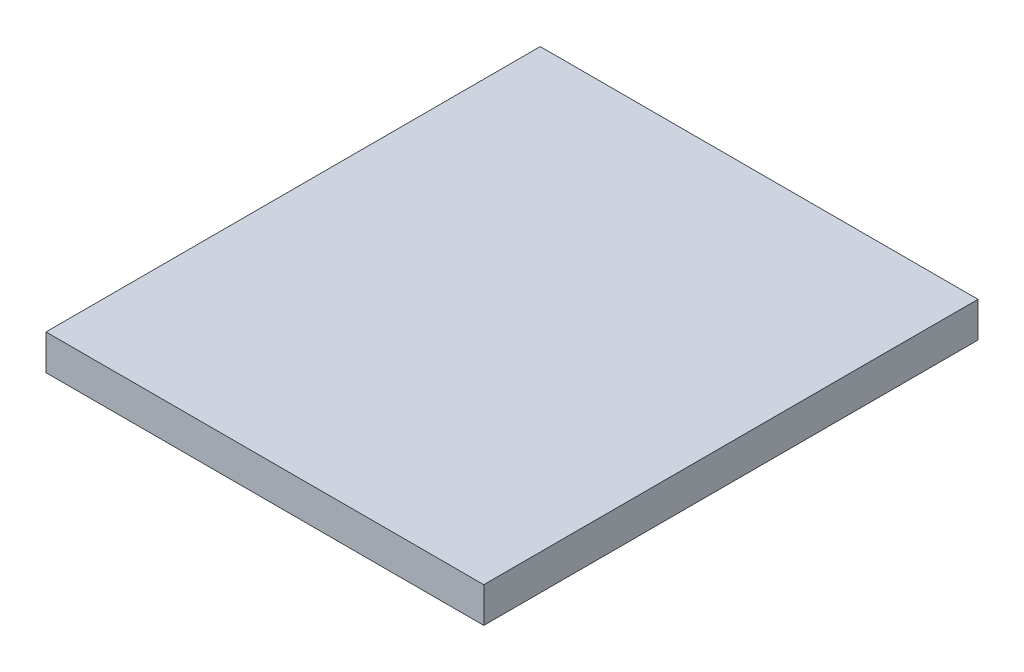
ISO-10303-21;
HEADER;
FILE_DESCRIPTION(('STEP AP214'),'2;1');
FILE_NAME('part.step','',(''),(''),'','','');
FILE_SCHEMA(('AUTOMOTIVE_DESIGN { 1 0 10303 214 1 1 1 1 }'));
ENDSEC;
DATA;
#1=APPLICATION_CONTEXT('core data for automotive mechanical design processes');
#2=APPLICATION_PROTOCOL_DEFINITION('international standard','automotive_design',2000,#1);
#3=PRODUCT_CONTEXT('',#1,'mechanical');
#4=PRODUCT('Part','Part','',(#3));
#5=PRODUCT_RELATED_PRODUCT_CATEGORY('part','',(#4));
#6=PRODUCT_DEFINITION_FORMATION('','',#4);
#7=PRODUCT_DEFINITION_CONTEXT('part definition',#1,'design');
#8=PRODUCT_DEFINITION('design','',#6,#7);
#9=PRODUCT_DEFINITION_SHAPE('','',#8);
#10=(LENGTH_UNIT() NAMED_UNIT(*) SI_UNIT(.MILLI.,.METRE.));
#11=(NAMED_UNIT(*) PLANE_ANGLE_UNIT() SI_UNIT($,.RADIAN.));
#12=(NAMED_UNIT(*) SI_UNIT($,.STERADIAN.) SOLID_ANGLE_UNIT());
#13=UNCERTAINTY_MEASURE_WITH_UNIT(LENGTH_MEASURE(1.E-05),#10,'distance_accuracy_value','');
#14=(GEOMETRIC_REPRESENTATION_CONTEXT(3) GLOBAL_UNCERTAINTY_ASSIGNED_CONTEXT((#13)) GLOBAL_UNIT_ASSIGNED_CONTEXT((#10,
#11,#12)) REPRESENTATION_CONTEXT('',''));
#15=CARTESIAN_POINT('',(0.,0.,0.));
#16=DIRECTION('',(0.,0.,1.));
#17=DIRECTION('',(1.,0.,0.));
#18=AXIS2_PLACEMENT_3D('',#15,#16,#17);
#19=CARTESIAN_POINT('',(124.,1.,0.));
#20=DIRECTION('',(0.,0.,1.));
#21=DIRECTION('',(1.,0.,0.));
#22=AXIS2_PLACEMENT_3D('',#19,#20,#21);
#23=PLANE('',#22);
#24=DIRECTION('',(-1.,0.,0.));
#25=VECTOR('',#24,1.);
#26=CARTESIAN_POINT('',(124.,0.,0.));
#27=LINE('',#26,#25);
#28=CARTESIAN_POINT('',(123.,0.,0.));
#29=VERTEX_POINT('',#28);
#30=CARTESIAN_POINT('',(1.,0.,0.));
#31=VERTEX_POINT('',#30);
#32=EDGE_CURVE('E142',#29,#31,#27,.T.);
#33=ORIENTED_EDGE('',*,*,#32,.T.);
#34=DIRECTION('',(0.,1.,0.));
#35=VECTOR('',#34,1.);
#36=CARTESIAN_POINT('',(1.,-9.,0.));
#37=LINE('',#36,#35);
#38=CARTESIAN_POINT('',(1.,-9.,0.));
#39=VERTEX_POINT('',#38);
#40=EDGE_CURVE('E122',#39,#31,#37,.T.);
#41=ORIENTED_EDGE('',*,*,#40,.F.);
#42=DIRECTION('',(-1.,0.,0.));
#43=VECTOR('',#42,1.);
#44=CARTESIAN_POINT('',(1.,-9.,0.));
#45=LINE('',#44,#43);
#46=CARTESIAN_POINT('',(0.,-9.,0.));
#47=VERTEX_POINT('',#46);
#48=EDGE_CURVE('E115',#39,#47,#45,.T.);
#49=ORIENTED_EDGE('',*,*,#48,.T.);
#50=DIRECTION('',(0.,-1.,0.));
#51=VECTOR('',#50,1.);
#52=CARTESIAN_POINT('',(0.,1.,0.));
#53=LINE('',#52,#51);
#54=CARTESIAN_POINT('',(0.,1.,0.));
#55=VERTEX_POINT('',#54);
#56=EDGE_CURVE('E98',#55,#47,#53,.T.);
#57=ORIENTED_EDGE('',*,*,#56,.F.);
#58=DIRECTION('',(-1.,0.,0.));
#59=VECTOR('',#58,1.);
#60=CARTESIAN_POINT('',(124.,1.,0.));
#61=LINE('',#60,#59);
#62=CARTESIAN_POINT('',(124.,1.,0.));
#63=VERTEX_POINT('',#62);
#64=EDGE_CURVE('E151',#63,#55,#61,.T.);
#65=ORIENTED_EDGE('',*,*,#64,.F.);
#66=DIRECTION('',(0.,-1.,0.));
#67=VECTOR('',#66,1.);
#68=CARTESIAN_POINT('',(124.,1.,0.));
#69=LINE('',#68,#67);
#70=CARTESIAN_POINT('',(124.,-9.,0.));
#71=VERTEX_POINT('',#70);
#72=EDGE_CURVE('E156',#63,#71,#69,.T.);
#73=ORIENTED_EDGE('',*,*,#72,.T.);
#74=DIRECTION('',(-1.,0.,0.));
#75=VECTOR('',#74,1.);
#76=CARTESIAN_POINT('',(124.,-9.,0.));
#77=LINE('',#76,#75);
#78=CARTESIAN_POINT('',(123.,-9.,0.));
#79=VERTEX_POINT('',#78);
#80=EDGE_CURVE('E129',#71,#79,#77,.T.);
#81=ORIENTED_EDGE('',*,*,#80,.T.);
#82=DIRECTION('',(0.,1.,0.));
#83=VECTOR('',#82,1.);
#84=CARTESIAN_POINT('',(123.,-9.,0.));
#85=LINE('',#84,#83);
#86=EDGE_CURVE('E140',#79,#29,#85,.T.);
#87=ORIENTED_EDGE('',*,*,#86,.T.);
#88=EDGE_LOOP('',(#33,#41,#49,#57,#65,#73,#81,#87));
#89=FACE_BOUND('',#88,.T.);
#90=ADVANCED_FACE('F34',(#89),#23,.F.);
#91=CARTESIAN_POINT('',(0.,1.,0.));
#92=DIRECTION('',(1.,0.,0.));
#93=DIRECTION('',(0.,0.,-1.));
#94=AXIS2_PLACEMENT_3D('',#91,#92,#93);
#95=PLANE('',#94);
#96=ORIENTED_EDGE('',*,*,#56,.T.);
#97=DIRECTION('',(0.,0.,1.));
#98=VECTOR('',#97,1.);
#99=CARTESIAN_POINT('',(0.,-9.,0.));
#100=LINE('',#99,#98);
#101=CARTESIAN_POINT('',(0.,-9.,140.));
#102=VERTEX_POINT('',#101);
#103=EDGE_CURVE('E102',#47,#102,#100,.T.);
#104=ORIENTED_EDGE('',*,*,#103,.T.);
#105=DIRECTION('',(0.,-1.,0.));
#106=VECTOR('',#105,1.);
#107=CARTESIAN_POINT('',(0.,1.,140.));
#108=LINE('',#107,#106);
#109=CARTESIAN_POINT('',(0.,1.,140.));
#110=VERTEX_POINT('',#109);
#111=EDGE_CURVE('E108',#110,#102,#108,.T.);
#112=ORIENTED_EDGE('',*,*,#111,.F.);
#113=DIRECTION('',(0.,0.,1.));
#114=VECTOR('',#113,1.);
#115=CARTESIAN_POINT('',(0.,1.,0.));
#116=LINE('',#115,#114);
#117=EDGE_CURVE('E103',#55,#110,#116,.T.);
#118=ORIENTED_EDGE('',*,*,#117,.F.);
#119=EDGE_LOOP('',(#96,#104,#112,#118));
#120=FACE_BOUND('',#119,.T.);
#121=ADVANCED_FACE('F100',(#120),#95,.F.);
#122=CARTESIAN_POINT('',(0.,1.,140.));
#123=DIRECTION('',(0.,0.,-1.));
#124=DIRECTION('',(-1.,0.,0.));
#125=AXIS2_PLACEMENT_3D('',#122,#123,#124);
#126=PLANE('',#125);
#127=ORIENTED_EDGE('',*,*,#111,.T.);
#128=DIRECTION('',(1.,0.,0.));
#129=VECTOR('',#128,1.);
#130=CARTESIAN_POINT('',(0.,-9.,140.));
#131=LINE('',#130,#129);
#132=CARTESIAN_POINT('',(124.,-9.,140.));
#133=VERTEX_POINT('',#132);
#134=EDGE_CURVE('E119',#102,#133,#131,.T.);
#135=ORIENTED_EDGE('',*,*,#134,.T.);
#136=DIRECTION('',(0.,-1.,0.));
#137=VECTOR('',#136,1.);
#138=CARTESIAN_POINT('',(124.,1.,140.));
#139=LINE('',#138,#137);
#140=CARTESIAN_POINT('',(124.,1.,140.));
#141=VERTEX_POINT('',#140);
#142=EDGE_CURVE('E159',#141,#133,#139,.T.);
#143=ORIENTED_EDGE('',*,*,#142,.F.);
#144=DIRECTION('',(1.,0.,0.));
#145=VECTOR('',#144,1.);
#146=CARTESIAN_POINT('',(0.,1.,140.));
#147=LINE('',#146,#145);
#148=EDGE_CURVE('E53',#110,#141,#147,.T.);
#149=ORIENTED_EDGE('',*,*,#148,.F.);
#150=EDGE_LOOP('',(#127,#135,#143,#149));
#151=FACE_BOUND('',#150,.T.);
#152=ADVANCED_FACE('F177',(#151),#126,.F.);
#153=CARTESIAN_POINT('',(124.,1.,140.));
#154=DIRECTION('',(-1.,0.,0.));
#155=DIRECTION('',(0.,0.,1.));
#156=AXIS2_PLACEMENT_3D('',#153,#154,#155);
#157=PLANE('',#156);
#158=ORIENTED_EDGE('',*,*,#142,.T.);
#159=DIRECTION('',(0.,0.,-1.));
#160=VECTOR('',#159,1.);
#161=CARTESIAN_POINT('',(124.,-9.,140.));
#162=LINE('',#161,#160);
#163=EDGE_CURVE('E126',#133,#71,#162,.T.);
#164=ORIENTED_EDGE('',*,*,#163,.T.);
#165=ORIENTED_EDGE('',*,*,#72,.F.);
#166=DIRECTION('',(0.,0.,-1.));
#167=VECTOR('',#166,1.);
#168=CARTESIAN_POINT('',(124.,1.,140.));
#169=LINE('',#168,#167);
#170=EDGE_CURVE('E48',#141,#63,#169,.T.);
#171=ORIENTED_EDGE('',*,*,#170,.F.);
#172=EDGE_LOOP('',(#158,#164,#165,#171));
#173=FACE_BOUND('',#172,.T.);
#174=ADVANCED_FACE('F175',(#173),#157,.F.);
#175=CARTESIAN_POINT('',(0.,1.,0.));
#176=DIRECTION('',(0.,1.,0.));
#177=DIRECTION('',(0.,0.,1.));
#178=AXIS2_PLACEMENT_3D('',#175,#176,#177);
#179=PLANE('',#178);
#180=ORIENTED_EDGE('',*,*,#64,.T.);
#181=ORIENTED_EDGE('',*,*,#117,.T.);
#182=ORIENTED_EDGE('',*,*,#148,.T.);
#183=ORIENTED_EDGE('',*,*,#170,.T.);
#184=EDGE_LOOP('',(#180,#181,#182,#183));
#185=FACE_BOUND('',#184,.T.);
#186=ADVANCED_FACE('F184',(#185),#179,.T.);
#187=CARTESIAN_POINT('',(0.,0.,0.));
#188=DIRECTION('',(0.,1.,0.));
#189=DIRECTION('',(0.,0.,1.));
#190=AXIS2_PLACEMENT_3D('',#187,#188,#189);
#191=PLANE('',#190);
#192=DIRECTION('',(-1.,0.,0.));
#193=VECTOR('',#192,1.);
#194=CARTESIAN_POINT('',(0.,0.,139.));
#195=LINE('',#194,#193);
#196=CARTESIAN_POINT('',(123.,0.,139.));
#197=VERTEX_POINT('',#196);
#198=CARTESIAN_POINT('',(1.,0.,139.));
#199=VERTEX_POINT('',#198);
#200=EDGE_CURVE('E41',#197,#199,#195,.T.);
#201=ORIENTED_EDGE('',*,*,#200,.T.);
#202=DIRECTION('',(0.,0.,-1.));
#203=VECTOR('',#202,1.);
#204=CARTESIAN_POINT('',(1.,0.,0.));
#205=LINE('',#204,#203);
#206=EDGE_CURVE('E11',#199,#31,#205,.T.);
#207=ORIENTED_EDGE('',*,*,#206,.T.);
#208=ORIENTED_EDGE('',*,*,#32,.F.);
#209=DIRECTION('',(0.,0.,1.));
#210=VECTOR('',#209,1.);
#211=CARTESIAN_POINT('',(123.,0.,0.));
#212=LINE('',#211,#210);
#213=EDGE_CURVE('E107',#29,#197,#212,.T.);
#214=ORIENTED_EDGE('',*,*,#213,.T.);
#215=EDGE_LOOP('',(#201,#207,#208,#214));
#216=FACE_BOUND('',#215,.T.);
#217=ADVANCED_FACE('F165',(#216),#191,.F.);
#218=CARTESIAN_POINT('',(1.,-9.,139.));
#219=DIRECTION('',(1.,0.,0.));
#220=DIRECTION('',(0.,0.,-1.));
#221=AXIS2_PLACEMENT_3D('',#218,#219,#220);
#222=PLANE('',#221);
#223=ORIENTED_EDGE('',*,*,#206,.F.);
#224=DIRECTION('',(0.,1.,0.));
#225=VECTOR('',#224,1.);
#226=CARTESIAN_POINT('',(1.,-9.,139.));
#227=LINE('',#226,#225);
#228=CARTESIAN_POINT('',(1.,-9.,139.));
#229=VERTEX_POINT('',#228);
#230=EDGE_CURVE('E143',#229,#199,#227,.T.);
#231=ORIENTED_EDGE('',*,*,#230,.F.);
#232=DIRECTION('',(0.,0.,-1.));
#233=VECTOR('',#232,1.);
#234=CARTESIAN_POINT('',(1.,-9.,139.));
#235=LINE('',#234,#233);
#236=EDGE_CURVE('E138',#229,#39,#235,.T.);
#237=ORIENTED_EDGE('',*,*,#236,.T.);
#238=ORIENTED_EDGE('',*,*,#40,.T.);
#239=EDGE_LOOP('',(#223,#231,#237,#238));
#240=FACE_BOUND('',#239,.T.);
#241=ADVANCED_FACE('F224',(#240),#222,.T.);
#242=CARTESIAN_POINT('',(123.,-9.,139.));
#243=DIRECTION('',(0.,0.,-1.));
#244=DIRECTION('',(-1.,0.,0.));
#245=AXIS2_PLACEMENT_3D('',#242,#243,#244);
#246=PLANE('',#245);
#247=ORIENTED_EDGE('',*,*,#200,.F.);
#248=DIRECTION('',(0.,1.,0.));
#249=VECTOR('',#248,1.);
#250=CARTESIAN_POINT('',(123.,-9.,139.));
#251=LINE('',#250,#249);
#252=CARTESIAN_POINT('',(123.,-9.,139.));
#253=VERTEX_POINT('',#252);
#254=EDGE_CURVE('E146',#253,#197,#251,.T.);
#255=ORIENTED_EDGE('',*,*,#254,.F.);
#256=DIRECTION('',(-1.,0.,0.));
#257=VECTOR('',#256,1.);
#258=CARTESIAN_POINT('',(123.,-9.,139.));
#259=LINE('',#258,#257);
#260=EDGE_CURVE('E135',#253,#229,#259,.T.);
#261=ORIENTED_EDGE('',*,*,#260,.T.);
#262=ORIENTED_EDGE('',*,*,#230,.T.);
#263=EDGE_LOOP('',(#247,#255,#261,#262));
#264=FACE_BOUND('',#263,.T.);
#265=ADVANCED_FACE('F168',(#264),#246,.T.);
#266=CARTESIAN_POINT('',(123.,-9.,0.));
#267=DIRECTION('',(-1.,0.,0.));
#268=DIRECTION('',(0.,0.,1.));
#269=AXIS2_PLACEMENT_3D('',#266,#267,#268);
#270=PLANE('',#269);
#271=ORIENTED_EDGE('',*,*,#213,.F.);
#272=ORIENTED_EDGE('',*,*,#86,.F.);
#273=DIRECTION('',(0.,0.,1.));
#274=VECTOR('',#273,1.);
#275=CARTESIAN_POINT('',(123.,-9.,0.));
#276=LINE('',#275,#274);
#277=EDGE_CURVE('E132',#79,#253,#276,.T.);
#278=ORIENTED_EDGE('',*,*,#277,.T.);
#279=ORIENTED_EDGE('',*,*,#254,.T.);
#280=EDGE_LOOP('',(#271,#272,#278,#279));
#281=FACE_BOUND('',#280,.T.);
#282=ADVANCED_FACE('F171',(#281),#270,.T.);
#283=CARTESIAN_POINT('',(0.,-9.,0.));
#284=DIRECTION('',(0.,1.,0.));
#285=DIRECTION('',(0.,0.,1.));
#286=AXIS2_PLACEMENT_3D('',#283,#284,#285);
#287=PLANE('',#286);
#288=ORIENTED_EDGE('',*,*,#48,.F.);
#289=ORIENTED_EDGE('',*,*,#236,.F.);
#290=ORIENTED_EDGE('',*,*,#260,.F.);
#291=ORIENTED_EDGE('',*,*,#277,.F.);
#292=ORIENTED_EDGE('',*,*,#80,.F.);
#293=ORIENTED_EDGE('',*,*,#163,.F.);
#294=ORIENTED_EDGE('',*,*,#134,.F.);
#295=ORIENTED_EDGE('',*,*,#103,.F.);
#296=EDGE_LOOP('',(#288,#289,#290,#291,#292,#293,#294,#295));
#297=FACE_BOUND('',#296,.T.);
#298=ADVANCED_FACE('F113',(#297),#287,.F.);
#299=CLOSED_SHELL('',(#90,#121,#152,#174,#186,#217,#241,#265,#282,#298));
#300=MANIFOLD_SOLID_BREP('B2',#299);
#301=ADVANCED_BREP_SHAPE_REPRESENTATION('',(#18,#300),#14);
#302=SHAPE_DEFINITION_REPRESENTATION(#9,#301);
ENDSEC;
END-ISO-10303-21;
